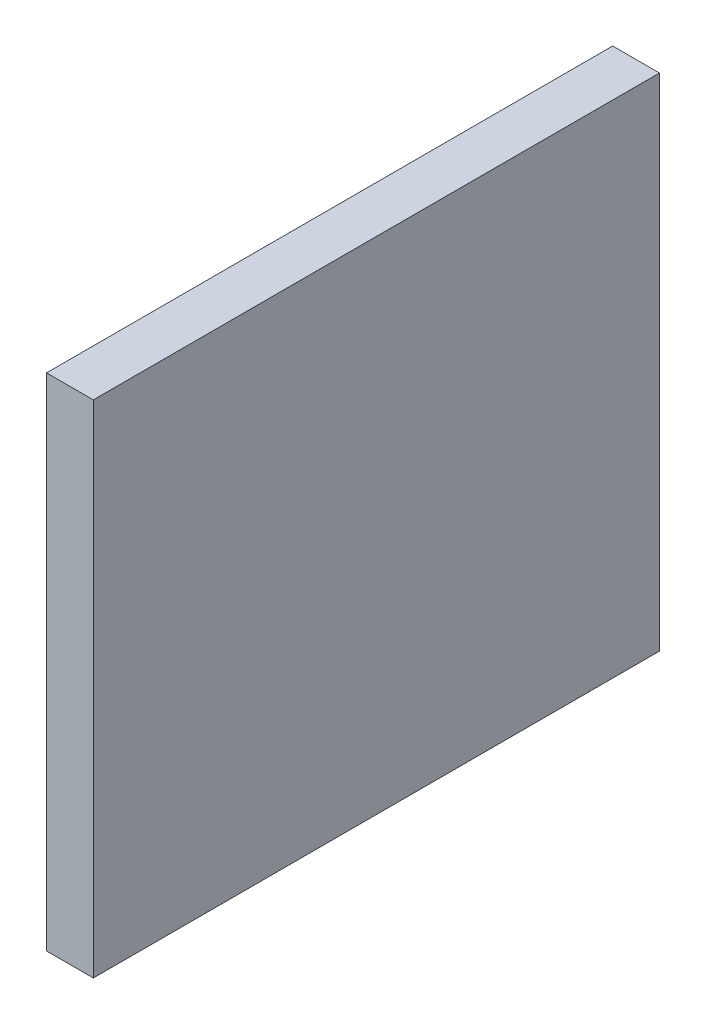
ISO-10303-21;
HEADER;
FILE_DESCRIPTION(('STEP AP214'),'2;1');
FILE_NAME('part.step','',(''),(''),'','','');
FILE_SCHEMA(('AUTOMOTIVE_DESIGN { 1 0 10303 214 1 1 1 1 }'));
ENDSEC;
DATA;
#1=APPLICATION_CONTEXT('core data for automotive mechanical design processes');
#2=APPLICATION_PROTOCOL_DEFINITION('international standard','automotive_design',2000,#1);
#3=PRODUCT_CONTEXT('',#1,'mechanical');
#4=PRODUCT('Part','Part','',(#3));
#5=PRODUCT_RELATED_PRODUCT_CATEGORY('part','',(#4));
#6=PRODUCT_DEFINITION_FORMATION('','',#4);
#7=PRODUCT_DEFINITION_CONTEXT('part definition',#1,'design');
#8=PRODUCT_DEFINITION('design','',#6,#7);
#9=PRODUCT_DEFINITION_SHAPE('','',#8);
#10=(LENGTH_UNIT() NAMED_UNIT(*) SI_UNIT(.MILLI.,.METRE.));
#11=(NAMED_UNIT(*) PLANE_ANGLE_UNIT() SI_UNIT($,.RADIAN.));
#12=(NAMED_UNIT(*) SI_UNIT($,.STERADIAN.) SOLID_ANGLE_UNIT());
#13=UNCERTAINTY_MEASURE_WITH_UNIT(LENGTH_MEASURE(1.E-05),#10,'distance_accuracy_value','');
#14=(GEOMETRIC_REPRESENTATION_CONTEXT(3) GLOBAL_UNCERTAINTY_ASSIGNED_CONTEXT((#13)) GLOBAL_UNIT_ASSIGNED_CONTEXT((#10,
#11,#12)) REPRESENTATION_CONTEXT('',''));
#15=CARTESIAN_POINT('',(0.,0.,0.));
#16=DIRECTION('',(0.,0.,1.));
#17=DIRECTION('',(1.,0.,0.));
#18=AXIS2_PLACEMENT_3D('',#15,#16,#17);
#19=CARTESIAN_POINT('',(-122.1,0.,-217.564426124934));
#20=DIRECTION('',(-1.,0.,0.));
#21=DIRECTION('',(0.,-1.,0.));
#22=AXIS2_PLACEMENT_3D('',#19,#20,#21);
#23=PLANE('',#22);
#24=DIRECTION('',(0.,1.,0.));
#25=VECTOR('',#24,1.);
#26=CARTESIAN_POINT('',(-122.1,0.,-271.3));
#27=LINE('',#26,#25);
#28=CARTESIAN_POINT('',(-122.1,-53.5024476045967,-271.3));
#29=VERTEX_POINT('',#28);
#30=CARTESIAN_POINT('',(-122.1,0.,-271.3));
#31=VERTEX_POINT('',#30);
#32=EDGE_CURVE('E83',#29,#31,#27,.T.);
#33=ORIENTED_EDGE('',*,*,#32,.F.);
#34=DIRECTION('',(0.,0.,-1.));
#35=VECTOR('',#34,1.);
#36=CARTESIAN_POINT('',(-122.1,-53.5024476045967,-217.564426124934));
#37=LINE('',#36,#35);
#38=CARTESIAN_POINT('',(-122.1,-53.5024476045967,-331.8));
#39=VERTEX_POINT('',#38);
#40=EDGE_CURVE('E37',#29,#39,#37,.T.);
#41=ORIENTED_EDGE('',*,*,#40,.T.);
#42=DIRECTION('',(0.,1.,0.));
#43=VECTOR('',#42,1.);
#44=CARTESIAN_POINT('',(-122.1,0.,-331.8));
#45=LINE('',#44,#43);
#46=CARTESIAN_POINT('',(-122.1,0.,-331.8));
#47=VERTEX_POINT('',#46);
#48=EDGE_CURVE('E81',#39,#47,#45,.T.);
#49=ORIENTED_EDGE('',*,*,#48,.T.);
#50=DIRECTION('',(0.,0.,-1.));
#51=VECTOR('',#50,1.);
#52=CARTESIAN_POINT('',(-122.1,0.,-217.564426124934));
#53=LINE('',#52,#51);
#54=EDGE_CURVE('E72',#31,#47,#53,.T.);
#55=ORIENTED_EDGE('',*,*,#54,.F.);
#56=EDGE_LOOP('',(#33,#41,#49,#55));
#57=FACE_BOUND('',#56,.T.);
#58=ADVANCED_FACE('F33',(#57),#23,.F.);
#59=CARTESIAN_POINT('',(-122.1,0.,-217.564426124934));
#60=DIRECTION('',(0.,-1.,0.));
#61=DIRECTION('',(0.,0.,-1.));
#62=AXIS2_PLACEMENT_3D('',#59,#60,#61);
#63=PLANE('',#62);
#64=DIRECTION('',(-1.,0.,0.));
#65=VECTOR('',#64,1.);
#66=CARTESIAN_POINT('',(-249.600000000001,-9.99200722162641E-13,-271.3));
#67=LINE('',#66,#65);
#68=CARTESIAN_POINT('',(-127.1,0.,-271.3));
#69=VERTEX_POINT('',#68);
#70=EDGE_CURVE('E42',#31,#69,#67,.T.);
#71=ORIENTED_EDGE('',*,*,#70,.F.);
#72=ORIENTED_EDGE('',*,*,#54,.T.);
#73=DIRECTION('',(-1.,0.,0.));
#74=VECTOR('',#73,1.);
#75=CARTESIAN_POINT('',(-122.1,0.,-331.8));
#76=LINE('',#75,#74);
#77=CARTESIAN_POINT('',(-127.1,0.,-331.8));
#78=VERTEX_POINT('',#77);
#79=EDGE_CURVE('E93',#47,#78,#76,.T.);
#80=ORIENTED_EDGE('',*,*,#79,.T.);
#81=DIRECTION('',(0.,0.,-1.));
#82=VECTOR('',#81,1.);
#83=CARTESIAN_POINT('',(-127.1,0.,-217.564426124934));
#84=LINE('',#83,#82);
#85=EDGE_CURVE('E102',#69,#78,#84,.T.);
#86=ORIENTED_EDGE('',*,*,#85,.F.);
#87=EDGE_LOOP('',(#71,#72,#80,#86));
#88=FACE_BOUND('',#87,.T.);
#89=ADVANCED_FACE('F106',(#88),#63,.F.);
#90=CARTESIAN_POINT('',(-127.1,0.,-217.564426124934));
#91=DIRECTION('',(1.,0.,0.));
#92=DIRECTION('',(0.,1.,0.));
#93=AXIS2_PLACEMENT_3D('',#90,#91,#92);
#94=PLANE('',#93);
#95=DIRECTION('',(0.,-1.,0.));
#96=VECTOR('',#95,1.);
#97=CARTESIAN_POINT('',(-127.1,0.,-271.3));
#98=LINE('',#97,#96);
#99=CARTESIAN_POINT('',(-127.1,-53.5024476045967,-271.3));
#100=VERTEX_POINT('',#99);
#101=EDGE_CURVE('E11',#69,#100,#98,.T.);
#102=ORIENTED_EDGE('',*,*,#101,.F.);
#103=ORIENTED_EDGE('',*,*,#85,.T.);
#104=DIRECTION('',(0.,-1.,0.));
#105=VECTOR('',#104,1.);
#106=CARTESIAN_POINT('',(-127.1,0.,-331.8));
#107=LINE('',#106,#105);
#108=CARTESIAN_POINT('',(-127.1,-53.5024476045967,-331.8));
#109=VERTEX_POINT('',#108);
#110=EDGE_CURVE('E103',#78,#109,#107,.T.);
#111=ORIENTED_EDGE('',*,*,#110,.T.);
#112=DIRECTION('',(0.,0.,-1.));
#113=VECTOR('',#112,1.);
#114=CARTESIAN_POINT('',(-127.1,-53.5024476045967,-217.564426124934));
#115=LINE('',#114,#113);
#116=EDGE_CURVE('E55',#100,#109,#115,.T.);
#117=ORIENTED_EDGE('',*,*,#116,.F.);
#118=EDGE_LOOP('',(#102,#103,#111,#117));
#119=FACE_BOUND('',#118,.T.);
#120=ADVANCED_FACE('F105',(#119),#94,.F.);
#121=CARTESIAN_POINT('',(-122.1,-53.5024476045967,-217.564426124934));
#122=DIRECTION('',(0.,1.,0.));
#123=DIRECTION('',(0.,0.,1.));
#124=AXIS2_PLACEMENT_3D('',#121,#122,#123);
#125=PLANE('',#124);
#126=DIRECTION('',(1.,0.,0.));
#127=VECTOR('',#126,1.);
#128=CARTESIAN_POINT('',(-122.1,-53.5024476045967,-271.3));
#129=LINE('',#128,#127);
#130=EDGE_CURVE('E90',#100,#29,#129,.T.);
#131=ORIENTED_EDGE('',*,*,#130,.F.);
#132=ORIENTED_EDGE('',*,*,#116,.T.);
#133=DIRECTION('',(1.,0.,0.));
#134=VECTOR('',#133,1.);
#135=CARTESIAN_POINT('',(-122.1,-53.5024476045967,-331.8));
#136=LINE('',#135,#134);
#137=EDGE_CURVE('E86',#109,#39,#136,.T.);
#138=ORIENTED_EDGE('',*,*,#137,.T.);
#139=ORIENTED_EDGE('',*,*,#40,.F.);
#140=EDGE_LOOP('',(#131,#132,#138,#139));
#141=FACE_BOUND('',#140,.T.);
#142=ADVANCED_FACE('F87',(#141),#125,.F.);
#143=CARTESIAN_POINT('',(0.,0.,-331.8));
#144=DIRECTION('',(0.,0.,-1.));
#145=DIRECTION('',(-1.,0.,0.));
#146=AXIS2_PLACEMENT_3D('',#143,#144,#145);
#147=PLANE('',#146);
#148=ORIENTED_EDGE('',*,*,#48,.F.);
#149=ORIENTED_EDGE('',*,*,#137,.F.);
#150=ORIENTED_EDGE('',*,*,#110,.F.);
#151=ORIENTED_EDGE('',*,*,#79,.F.);
#152=EDGE_LOOP('',(#148,#149,#150,#151));
#153=FACE_BOUND('',#152,.T.);
#154=ADVANCED_FACE('F92',(#153),#147,.T.);
#155=CARTESIAN_POINT('',(3147.83241786822,69.0000000000212,-271.3));
#156=DIRECTION('',(0.,0.,1.));
#157=DIRECTION('',(1.,0.,0.));
#158=AXIS2_PLACEMENT_3D('',#155,#156,#157);
#159=PLANE('',#158);
#160=ORIENTED_EDGE('',*,*,#130,.T.);
#161=ORIENTED_EDGE('',*,*,#32,.T.);
#162=ORIENTED_EDGE('',*,*,#70,.T.);
#163=ORIENTED_EDGE('',*,*,#101,.T.);
#164=EDGE_LOOP('',(#160,#161,#162,#163));
#165=FACE_BOUND('',#164,.T.);
#166=ADVANCED_FACE('F35',(#165),#159,.T.);
#167=CLOSED_SHELL('',(#58,#89,#120,#142,#154,#166));
#168=MANIFOLD_SOLID_BREP('B2',#167);
#169=ADVANCED_BREP_SHAPE_REPRESENTATION('',(#18,#168),#14);
#170=SHAPE_DEFINITION_REPRESENTATION(#9,#169);
ENDSEC;
END-ISO-10303-21;
